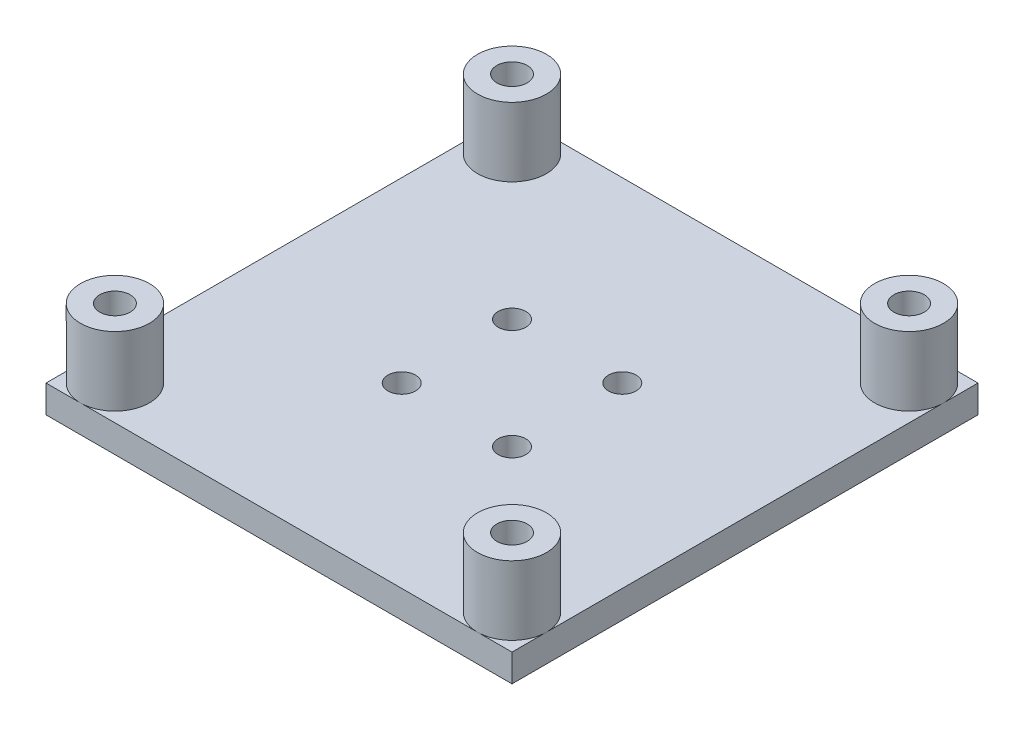
ISO-10303-21;
HEADER;
FILE_DESCRIPTION(('STEP AP214'),'2;1');
FILE_NAME('part.step','',(''),(''),'','','');
FILE_SCHEMA(('AUTOMOTIVE_DESIGN { 1 0 10303 214 1 1 1 1 }'));
ENDSEC;
DATA;
#1=APPLICATION_CONTEXT('core data for automotive mechanical design processes');
#2=APPLICATION_PROTOCOL_DEFINITION('international standard','automotive_design',2000,#1);
#3=PRODUCT_CONTEXT('',#1,'mechanical');
#4=PRODUCT('Part','Part','',(#3));
#5=PRODUCT_RELATED_PRODUCT_CATEGORY('part','',(#4));
#6=PRODUCT_DEFINITION_FORMATION('','',#4);
#7=PRODUCT_DEFINITION_CONTEXT('part definition',#1,'design');
#8=PRODUCT_DEFINITION('design','',#6,#7);
#9=PRODUCT_DEFINITION_SHAPE('','',#8);
#10=(LENGTH_UNIT() NAMED_UNIT(*) SI_UNIT(.MILLI.,.METRE.));
#11=(NAMED_UNIT(*) PLANE_ANGLE_UNIT() SI_UNIT($,.RADIAN.));
#12=(NAMED_UNIT(*) SI_UNIT($,.STERADIAN.) SOLID_ANGLE_UNIT());
#13=UNCERTAINTY_MEASURE_WITH_UNIT(LENGTH_MEASURE(1.E-05),#10,'distance_accuracy_value','');
#14=(GEOMETRIC_REPRESENTATION_CONTEXT(3) GLOBAL_UNCERTAINTY_ASSIGNED_CONTEXT((#13)) GLOBAL_UNIT_ASSIGNED_CONTEXT((#10,
#11,#12)) REPRESENTATION_CONTEXT('',''));
#15=CARTESIAN_POINT('',(0.,0.,0.));
#16=DIRECTION('',(0.,0.,1.));
#17=DIRECTION('',(1.,0.,0.));
#18=AXIS2_PLACEMENT_3D('',#15,#16,#17);
#19=CARTESIAN_POINT('',(0.,2.54,0.));
#20=DIRECTION('',(0.,1.,0.));
#21=DIRECTION('',(0.,0.,1.));
#22=AXIS2_PLACEMENT_3D('',#19,#20,#21);
#23=PLANE('',#22);
#24=DIRECTION('',(1.,0.,0.));
#25=VECTOR('',#24,1.);
#26=CARTESIAN_POINT('',(-48.8451315226756,2.54,23.6564176388459));
#27=LINE('',#26,#25);
#28=CARTESIAN_POINT('',(-48.8451315226756,2.54,23.6564176388459));
#29=VERTEX_POINT('',#28);
#30=CARTESIAN_POINT('',(-45.6701315226756,2.54,23.6564176388459));
#31=VERTEX_POINT('',#30);
#32=EDGE_CURVE('E108',#29,#31,#27,.T.);
#33=ORIENTED_EDGE('',*,*,#32,.T.);
#34=CARTESIAN_POINT('',(-45.6701315226756,2.54,20.4814176388459));
#35=DIRECTION('',(0.,1.,0.));
#36=DIRECTION('',(0.,0.,1.));
#37=AXIS2_PLACEMENT_3D('',#34,#35,#36);
#38=CIRCLE('',#37,3.17500000000002);
#39=CARTESIAN_POINT('',(-48.8451315226756,2.54,20.4814176388459));
#40=VERTEX_POINT('',#39);
#41=EDGE_CURVE('E49',#40,#31,#38,.T.);
#42=ORIENTED_EDGE('',*,*,#41,.F.);
#43=DIRECTION('',(0.,0.,1.));
#44=VECTOR('',#43,1.);
#45=CARTESIAN_POINT('',(-48.8451315226756,2.54,-19.2695823611541));
#46=LINE('',#45,#44);
#47=EDGE_CURVE('E106',#40,#29,#46,.T.);
#48=ORIENTED_EDGE('',*,*,#47,.T.);
#49=EDGE_LOOP('',(#33,#42,#48));
#50=FACE_BOUND('',#49,.T.);
#51=ADVANCED_FACE('F33',(#50),#23,.T.);
#52=CARTESIAN_POINT('',(-22.3021315226756,2.54,7.27341763884586));
#53=DIRECTION('',(0.,1.,0.));
#54=DIRECTION('',(0.,0.,1.));
#55=AXIS2_PLACEMENT_3D('',#52,#53,#54);
#56=CIRCLE('',#55,1.27);
#57=CARTESIAN_POINT('',(-22.3021315226756,2.54,8.54341763884586));
#58=VERTEX_POINT('',#57);
#59=EDGE_CURVE('E37',#58,#58,#56,.T.);
#60=ORIENTED_EDGE('',*,*,#59,.F.);
#61=EDGE_LOOP('',(#60));
#62=FACE_BOUND('',#61,.T.);
#63=CARTESIAN_POINT('',(-22.3021315226756,2.54,-2.88658236115414));
#64=DIRECTION('',(0.,1.,0.));
#65=DIRECTION('',(0.,0.,1.));
#66=AXIS2_PLACEMENT_3D('',#63,#64,#65);
#67=CIRCLE('',#66,1.27);
#68=CARTESIAN_POINT('',(-22.3021315226756,2.54,-1.61658236115414));
#69=VERTEX_POINT('',#68);
#70=EDGE_CURVE('E172',#69,#69,#67,.T.);
#71=ORIENTED_EDGE('',*,*,#70,.F.);
#72=EDGE_LOOP('',(#71));
#73=FACE_BOUND('',#72,.T.);
#74=CARTESIAN_POINT('',(-32.4621315226756,2.54,7.27341763884586));
#75=DIRECTION('',(0.,1.,0.));
#76=DIRECTION('',(0.,0.,1.));
#77=AXIS2_PLACEMENT_3D('',#74,#75,#76);
#78=CIRCLE('',#77,1.27);
#79=CARTESIAN_POINT('',(-32.4621315226756,2.54,8.54341763884585));
#80=VERTEX_POINT('',#79);
#81=EDGE_CURVE('E170',#80,#80,#78,.T.);
#82=ORIENTED_EDGE('',*,*,#81,.F.);
#83=EDGE_LOOP('',(#82));
#84=FACE_BOUND('',#83,.T.);
#85=CARTESIAN_POINT('',(-32.4621315226756,2.54,-2.88658236115415));
#86=DIRECTION('',(0.,1.,0.));
#87=DIRECTION('',(0.,0.,1.));
#88=AXIS2_PLACEMENT_3D('',#85,#86,#87);
#89=CIRCLE('',#88,1.27);
#90=CARTESIAN_POINT('',(-32.4621315226756,2.54,-1.61658236115415));
#91=VERTEX_POINT('',#90);
#92=EDGE_CURVE('E166',#91,#91,#89,.T.);
#93=ORIENTED_EDGE('',*,*,#92,.F.);
#94=EDGE_LOOP('',(#93));
#95=FACE_BOUND('',#94,.T.);
#96=CARTESIAN_POINT('',(-48.8451315226756,2.54,-16.0945823611541));
#97=VERTEX_POINT('',#96);
#98=EDGE_CURVE('E115',#97,#40,#46,.T.);
#99=ORIENTED_EDGE('',*,*,#98,.T.);
#100=EDGE_CURVE('E98',#31,#40,#38,.T.);
#101=ORIENTED_EDGE('',*,*,#100,.F.);
#102=CARTESIAN_POINT('',(-9.09413152267563,2.54,23.6564176388459));
#103=VERTEX_POINT('',#102);
#104=EDGE_CURVE('E56',#31,#103,#27,.T.);
#105=ORIENTED_EDGE('',*,*,#104,.T.);
#106=CARTESIAN_POINT('',(-9.09413152267563,2.54,20.4814176388459));
#107=DIRECTION('',(0.,1.,0.));
#108=DIRECTION('',(0.,0.,1.));
#109=AXIS2_PLACEMENT_3D('',#106,#107,#108);
#110=CIRCLE('',#109,3.175);
#111=CARTESIAN_POINT('',(-5.91913152267563,2.54,20.4814176388459));
#112=VERTEX_POINT('',#111);
#113=EDGE_CURVE('E250',#112,#103,#110,.T.);
#114=ORIENTED_EDGE('',*,*,#113,.F.);
#115=DIRECTION('',(0.,0.,-1.));
#116=VECTOR('',#115,1.);
#117=CARTESIAN_POINT('',(-5.91913152267563,2.54,-19.2695823611541));
#118=LINE('',#117,#116);
#119=CARTESIAN_POINT('',(-5.91913152267563,2.54,-16.0945823611541));
#120=VERTEX_POINT('',#119);
#121=EDGE_CURVE('E136',#112,#120,#118,.T.);
#122=ORIENTED_EDGE('',*,*,#121,.T.);
#123=CARTESIAN_POINT('',(-9.09413152267563,2.54,-16.0945823611541));
#124=DIRECTION('',(0.,1.,0.));
#125=DIRECTION('',(0.,0.,1.));
#126=AXIS2_PLACEMENT_3D('',#123,#124,#125);
#127=CIRCLE('',#126,3.175);
#128=CARTESIAN_POINT('',(-9.09413152267563,2.54,-19.2695823611541));
#129=VERTEX_POINT('',#128);
#130=EDGE_CURVE('E249',#129,#120,#127,.T.);
#131=ORIENTED_EDGE('',*,*,#130,.F.);
#132=DIRECTION('',(-1.,0.,0.));
#133=VECTOR('',#132,1.);
#134=CARTESIAN_POINT('',(-48.8451315226756,2.54,-19.2695823611541));
#135=LINE('',#134,#133);
#136=CARTESIAN_POINT('',(-45.6701315226756,2.54,-19.2695823611541));
#137=VERTEX_POINT('',#136);
#138=EDGE_CURVE('E141',#129,#137,#135,.T.);
#139=ORIENTED_EDGE('',*,*,#138,.T.);
#140=CARTESIAN_POINT('',(-45.6701315226756,2.54,-16.0945823611541));
#141=DIRECTION('',(0.,1.,0.));
#142=DIRECTION('',(0.,0.,1.));
#143=AXIS2_PLACEMENT_3D('',#140,#141,#142);
#144=CIRCLE('',#143,3.175);
#145=EDGE_CURVE('E124',#97,#137,#144,.T.);
#146=ORIENTED_EDGE('',*,*,#145,.F.);
#147=EDGE_LOOP('',(#99,#101,#105,#114,#122,#131,#139,#146));
#148=FACE_BOUND('',#147,.T.);
#149=ADVANCED_FACE('F122',(#62,#73,#84,#95,#148),#23,.T.);
#150=CARTESIAN_POINT('',(-5.91913152267563,2.54,23.6564176388459));
#151=VERTEX_POINT('',#150);
#152=EDGE_CURVE('E132',#151,#112,#118,.T.);
#153=ORIENTED_EDGE('',*,*,#152,.T.);
#154=EDGE_CURVE('E244',#103,#112,#110,.T.);
#155=ORIENTED_EDGE('',*,*,#154,.F.);
#156=EDGE_CURVE('E125',#103,#151,#27,.T.);
#157=ORIENTED_EDGE('',*,*,#156,.T.);
#158=EDGE_LOOP('',(#153,#155,#157));
#159=FACE_BOUND('',#158,.T.);
#160=ADVANCED_FACE('F183',(#159),#23,.T.);
#161=CARTESIAN_POINT('',(-5.91913152267563,2.54,-19.2695823611541));
#162=VERTEX_POINT('',#161);
#163=EDGE_CURVE('E137',#162,#129,#135,.T.);
#164=ORIENTED_EDGE('',*,*,#163,.T.);
#165=EDGE_CURVE('E221',#120,#129,#127,.T.);
#166=ORIENTED_EDGE('',*,*,#165,.F.);
#167=EDGE_CURVE('E131',#120,#162,#118,.T.);
#168=ORIENTED_EDGE('',*,*,#167,.T.);
#169=EDGE_LOOP('',(#164,#166,#168));
#170=FACE_BOUND('',#169,.T.);
#171=ADVANCED_FACE('F204',(#170),#23,.T.);
#172=EDGE_CURVE('E233',#137,#97,#144,.T.);
#173=ORIENTED_EDGE('',*,*,#172,.F.);
#174=CARTESIAN_POINT('',(-48.8451315226756,2.54,-19.2695823611541));
#175=VERTEX_POINT('',#174);
#176=EDGE_CURVE('E135',#137,#175,#135,.T.);
#177=ORIENTED_EDGE('',*,*,#176,.T.);
#178=EDGE_CURVE('E121',#175,#97,#46,.T.);
#179=ORIENTED_EDGE('',*,*,#178,.T.);
#180=EDGE_LOOP('',(#173,#177,#179));
#181=FACE_BOUND('',#180,.T.);
#182=ADVANCED_FACE('F210',(#181),#23,.T.);
#183=CARTESIAN_POINT('',(0.,0.,0.));
#184=DIRECTION('',(0.,1.,0.));
#185=DIRECTION('',(0.,0.,1.));
#186=AXIS2_PLACEMENT_3D('',#183,#184,#185);
#187=PLANE('',#186);
#188=CARTESIAN_POINT('',(-32.4621315226756,0.,-2.88658236115415));
#189=DIRECTION('',(0.,1.,0.));
#190=DIRECTION('',(0.,0.,1.));
#191=AXIS2_PLACEMENT_3D('',#188,#189,#190);
#192=CIRCLE('',#191,3.175);
#193=CARTESIAN_POINT('',(-32.4621315226756,0.,0.288417638845856));
#194=VERTEX_POINT('',#193);
#195=EDGE_CURVE('E11',#194,#194,#192,.F.);
#196=ORIENTED_EDGE('',*,*,#195,.F.);
#197=EDGE_LOOP('',(#196));
#198=FACE_BOUND('',#197,.T.);
#199=CARTESIAN_POINT('',(-22.3021315226756,0.,-2.88658236115414));
#200=DIRECTION('',(0.,1.,0.));
#201=DIRECTION('',(0.,0.,1.));
#202=AXIS2_PLACEMENT_3D('',#199,#200,#201);
#203=CIRCLE('',#202,3.175);
#204=CARTESIAN_POINT('',(-22.3021315226756,0.,0.288417638845859));
#205=VERTEX_POINT('',#204);
#206=EDGE_CURVE('E42',#205,#205,#203,.F.);
#207=ORIENTED_EDGE('',*,*,#206,.F.);
#208=EDGE_LOOP('',(#207));
#209=FACE_BOUND('',#208,.T.);
#210=CARTESIAN_POINT('',(-22.3021315226756,0.,7.27341763884586));
#211=DIRECTION('',(0.,1.,0.));
#212=DIRECTION('',(0.,0.,1.));
#213=AXIS2_PLACEMENT_3D('',#210,#211,#212);
#214=CIRCLE('',#213,3.175);
#215=CARTESIAN_POINT('',(-22.3021315226756,0.,10.4484176388459));
#216=VERTEX_POINT('',#215);
#217=EDGE_CURVE('E161',#216,#216,#214,.F.);
#218=ORIENTED_EDGE('',*,*,#217,.F.);
#219=EDGE_LOOP('',(#218));
#220=FACE_BOUND('',#219,.T.);
#221=CARTESIAN_POINT('',(-32.4621315226756,0.,7.27341763884586));
#222=DIRECTION('',(0.,1.,0.));
#223=DIRECTION('',(0.,0.,1.));
#224=AXIS2_PLACEMENT_3D('',#221,#222,#223);
#225=CIRCLE('',#224,3.175);
#226=CARTESIAN_POINT('',(-32.4621315226756,0.,10.4484176388459));
#227=VERTEX_POINT('',#226);
#228=EDGE_CURVE('E158',#227,#227,#225,.F.);
#229=ORIENTED_EDGE('',*,*,#228,.F.);
#230=EDGE_LOOP('',(#229));
#231=FACE_BOUND('',#230,.T.);
#232=DIRECTION('',(0.,0.,1.));
#233=VECTOR('',#232,1.);
#234=CARTESIAN_POINT('',(-48.8451315226756,0.,-19.2695823611541));
#235=LINE('',#234,#233);
#236=CARTESIAN_POINT('',(-48.8451315226756,0.,-19.2695823611541));
#237=VERTEX_POINT('',#236);
#238=CARTESIAN_POINT('',(-48.8451315226756,0.,23.6564176388459));
#239=VERTEX_POINT('',#238);
#240=EDGE_CURVE('E142',#237,#239,#235,.T.);
#241=ORIENTED_EDGE('',*,*,#240,.F.);
#242=DIRECTION('',(-1.,0.,0.));
#243=VECTOR('',#242,1.);
#244=CARTESIAN_POINT('',(-48.8451315226756,0.,-19.2695823611541));
#245=LINE('',#244,#243);
#246=CARTESIAN_POINT('',(-5.91913152267563,0.,-19.2695823611541));
#247=VERTEX_POINT('',#246);
#248=EDGE_CURVE('E119',#247,#237,#245,.T.);
#249=ORIENTED_EDGE('',*,*,#248,.F.);
#250=DIRECTION('',(0.,0.,-1.));
#251=VECTOR('',#250,1.);
#252=CARTESIAN_POINT('',(-5.91913152267563,0.,-19.2695823611541));
#253=LINE('',#252,#251);
#254=CARTESIAN_POINT('',(-5.91913152267563,0.,23.6564176388459));
#255=VERTEX_POINT('',#254);
#256=EDGE_CURVE('E146',#255,#247,#253,.T.);
#257=ORIENTED_EDGE('',*,*,#256,.F.);
#258=DIRECTION('',(1.,0.,0.));
#259=VECTOR('',#258,1.);
#260=CARTESIAN_POINT('',(-48.8451315226756,0.,23.6564176388459));
#261=LINE('',#260,#259);
#262=EDGE_CURVE('E144',#239,#255,#261,.T.);
#263=ORIENTED_EDGE('',*,*,#262,.F.);
#264=EDGE_LOOP('',(#241,#249,#257,#263));
#265=FACE_BOUND('',#264,.T.);
#266=CARTESIAN_POINT('',(-45.6701315226756,0.,-16.0945823611541));
#267=DIRECTION('',(0.,1.,0.));
#268=DIRECTION('',(0.,0.,1.));
#269=AXIS2_PLACEMENT_3D('',#266,#267,#268);
#270=CIRCLE('',#269,1.39700000000001);
#271=CARTESIAN_POINT('',(-45.6701315226756,0.,-14.6975823611541));
#272=VERTEX_POINT('',#271);
#273=EDGE_CURVE('E128',#272,#272,#270,.T.);
#274=ORIENTED_EDGE('',*,*,#273,.T.);
#275=EDGE_LOOP('',(#274));
#276=FACE_BOUND('',#275,.T.);
#277=CARTESIAN_POINT('',(-9.09413152267563,0.,-16.0945823611541));
#278=DIRECTION('',(0.,1.,0.));
#279=DIRECTION('',(0.,0.,1.));
#280=AXIS2_PLACEMENT_3D('',#277,#278,#279);
#281=CIRCLE('',#280,1.397);
#282=CARTESIAN_POINT('',(-9.09413152267563,0.,-14.6975823611541));
#283=VERTEX_POINT('',#282);
#284=EDGE_CURVE('E273',#283,#283,#281,.T.);
#285=ORIENTED_EDGE('',*,*,#284,.T.);
#286=EDGE_LOOP('',(#285));
#287=FACE_BOUND('',#286,.T.);
#288=CARTESIAN_POINT('',(-45.6701315226756,0.,20.4814176388459));
#289=DIRECTION('',(0.,1.,0.));
#290=DIRECTION('',(0.,0.,1.));
#291=AXIS2_PLACEMENT_3D('',#288,#289,#290);
#292=CIRCLE('',#291,1.39700000000001);
#293=CARTESIAN_POINT('',(-45.6701315226756,0.,21.8784176388459));
#294=VERTEX_POINT('',#293);
#295=EDGE_CURVE('E271',#294,#294,#292,.T.);
#296=ORIENTED_EDGE('',*,*,#295,.T.);
#297=EDGE_LOOP('',(#296));
#298=FACE_BOUND('',#297,.T.);
#299=CARTESIAN_POINT('',(-9.09413152267563,0.,20.4814176388459));
#300=DIRECTION('',(0.,1.,0.));
#301=DIRECTION('',(0.,0.,1.));
#302=AXIS2_PLACEMENT_3D('',#299,#300,#301);
#303=CIRCLE('',#302,1.397);
#304=CARTESIAN_POINT('',(-9.09413152267563,0.,21.8784176388459));
#305=VERTEX_POINT('',#304);
#306=EDGE_CURVE('E267',#305,#305,#303,.T.);
#307=ORIENTED_EDGE('',*,*,#306,.T.);
#308=EDGE_LOOP('',(#307));
#309=FACE_BOUND('',#308,.T.);
#310=ADVANCED_FACE('F216',(#198,#209,#220,#231,#265,#276,#287,#298,#309),#187,.F.);
#311=CARTESIAN_POINT('',(-48.8451315226756,2.54,-19.2695823611541));
#312=DIRECTION('',(1.,0.,0.));
#313=DIRECTION('',(0.,0.,-1.));
#314=AXIS2_PLACEMENT_3D('',#311,#312,#313);
#315=PLANE('',#314);
#316=ORIENTED_EDGE('',*,*,#240,.T.);
#317=DIRECTION('',(0.,-1.,0.));
#318=VECTOR('',#317,1.);
#319=CARTESIAN_POINT('',(-48.8451315226756,2.54,23.6564176388459));
#320=LINE('',#319,#318);
#321=EDGE_CURVE('E118',#29,#239,#320,.T.);
#322=ORIENTED_EDGE('',*,*,#321,.F.);
#323=ORIENTED_EDGE('',*,*,#47,.F.);
#324=ORIENTED_EDGE('',*,*,#98,.F.);
#325=ORIENTED_EDGE('',*,*,#178,.F.);
#326=DIRECTION('',(0.,-1.,0.));
#327=VECTOR('',#326,1.);
#328=CARTESIAN_POINT('',(-48.8451315226756,2.54,-19.2695823611541));
#329=LINE('',#328,#327);
#330=EDGE_CURVE('E140',#175,#237,#329,.T.);
#331=ORIENTED_EDGE('',*,*,#330,.T.);
#332=EDGE_LOOP('',(#316,#322,#323,#324,#325,#331));
#333=FACE_BOUND('',#332,.T.);
#334=ADVANCED_FACE('F35',(#333),#315,.F.);
#335=CARTESIAN_POINT('',(-48.8451315226756,2.54,23.6564176388459));
#336=DIRECTION('',(0.,0.,-1.));
#337=DIRECTION('',(-1.,0.,0.));
#338=AXIS2_PLACEMENT_3D('',#335,#336,#337);
#339=PLANE('',#338);
#340=ORIENTED_EDGE('',*,*,#262,.T.);
#341=DIRECTION('',(0.,-1.,0.));
#342=VECTOR('',#341,1.);
#343=CARTESIAN_POINT('',(-5.91913152267563,2.54,23.6564176388459));
#344=LINE('',#343,#342);
#345=EDGE_CURVE('E154',#151,#255,#344,.T.);
#346=ORIENTED_EDGE('',*,*,#345,.F.);
#347=ORIENTED_EDGE('',*,*,#156,.F.);
#348=ORIENTED_EDGE('',*,*,#104,.F.);
#349=ORIENTED_EDGE('',*,*,#32,.F.);
#350=ORIENTED_EDGE('',*,*,#321,.T.);
#351=EDGE_LOOP('',(#340,#346,#347,#348,#349,#350));
#352=FACE_BOUND('',#351,.T.);
#353=ADVANCED_FACE('F240',(#352),#339,.F.);
#354=CARTESIAN_POINT('',(-5.91913152267563,2.54,-19.2695823611541));
#355=DIRECTION('',(-1.,0.,0.));
#356=DIRECTION('',(0.,0.,1.));
#357=AXIS2_PLACEMENT_3D('',#354,#355,#356);
#358=PLANE('',#357);
#359=ORIENTED_EDGE('',*,*,#256,.T.);
#360=DIRECTION('',(0.,-1.,0.));
#361=VECTOR('',#360,1.);
#362=CARTESIAN_POINT('',(-5.91913152267563,2.54,-19.2695823611541));
#363=LINE('',#362,#361);
#364=EDGE_CURVE('E151',#162,#247,#363,.T.);
#365=ORIENTED_EDGE('',*,*,#364,.F.);
#366=ORIENTED_EDGE('',*,*,#167,.F.);
#367=ORIENTED_EDGE('',*,*,#121,.F.);
#368=ORIENTED_EDGE('',*,*,#152,.F.);
#369=ORIENTED_EDGE('',*,*,#345,.T.);
#370=EDGE_LOOP('',(#359,#365,#366,#367,#368,#369));
#371=FACE_BOUND('',#370,.T.);
#372=ADVANCED_FACE('F247',(#371),#358,.F.);
#373=CARTESIAN_POINT('',(-48.8451315226756,2.54,-19.2695823611541));
#374=DIRECTION('',(0.,0.,1.));
#375=DIRECTION('',(1.,0.,0.));
#376=AXIS2_PLACEMENT_3D('',#373,#374,#375);
#377=PLANE('',#376);
#378=ORIENTED_EDGE('',*,*,#248,.T.);
#379=ORIENTED_EDGE('',*,*,#330,.F.);
#380=ORIENTED_EDGE('',*,*,#176,.F.);
#381=ORIENTED_EDGE('',*,*,#138,.F.);
#382=ORIENTED_EDGE('',*,*,#163,.F.);
#383=ORIENTED_EDGE('',*,*,#364,.T.);
#384=EDGE_LOOP('',(#378,#379,#380,#381,#382,#383));
#385=FACE_BOUND('',#384,.T.);
#386=ADVANCED_FACE('F226',(#385),#377,.F.);
#387=CARTESIAN_POINT('',(-45.6701315226756,2.54,-16.0945823611541));
#388=DIRECTION('',(0.,-1.,0.));
#389=DIRECTION('',(0.,0.,-1.));
#390=AXIS2_PLACEMENT_3D('',#387,#388,#389);
#391=CYLINDRICAL_SURFACE('',#390,1.39700000000001);
#392=ORIENTED_EDGE('',*,*,#273,.F.);
#393=EDGE_LOOP('',(#392));
#394=FACE_BOUND('',#393,.T.);
#395=CARTESIAN_POINT('',(-45.6701315226756,8.89,-16.0945823611541));
#396=DIRECTION('',(0.,1.,0.));
#397=DIRECTION('',(0.,0.,1.));
#398=AXIS2_PLACEMENT_3D('',#395,#396,#397);
#399=CIRCLE('',#398,1.39700000000001);
#400=CARTESIAN_POINT('',(-45.6701315226756,8.89,-14.6975823611541));
#401=VERTEX_POINT('',#400);
#402=EDGE_CURVE('E261',#401,#401,#399,.T.);
#403=ORIENTED_EDGE('',*,*,#402,.T.);
#404=EDGE_LOOP('',(#403));
#405=FACE_BOUND('',#404,.T.);
#406=ADVANCED_FACE('F280',(#394,#405),#391,.F.);
#407=CARTESIAN_POINT('',(-9.09413152267563,2.54,-16.0945823611541));
#408=DIRECTION('',(0.,-1.,0.));
#409=DIRECTION('',(0.,0.,-1.));
#410=AXIS2_PLACEMENT_3D('',#407,#408,#409);
#411=CYLINDRICAL_SURFACE('',#410,1.397);
#412=ORIENTED_EDGE('',*,*,#284,.F.);
#413=EDGE_LOOP('',(#412));
#414=FACE_BOUND('',#413,.T.);
#415=CARTESIAN_POINT('',(-9.09413152267563,8.89,-16.0945823611541));
#416=DIRECTION('',(0.,1.,0.));
#417=DIRECTION('',(0.,0.,1.));
#418=AXIS2_PLACEMENT_3D('',#415,#416,#417);
#419=CIRCLE('',#418,1.397);
#420=CARTESIAN_POINT('',(-9.09413152267563,8.89,-14.6975823611541));
#421=VERTEX_POINT('',#420);
#422=EDGE_CURVE('E253',#421,#421,#419,.T.);
#423=ORIENTED_EDGE('',*,*,#422,.T.);
#424=EDGE_LOOP('',(#423));
#425=FACE_BOUND('',#424,.T.);
#426=ADVANCED_FACE('F283',(#414,#425),#411,.F.);
#427=CARTESIAN_POINT('',(-45.6701315226756,2.54,20.4814176388459));
#428=DIRECTION('',(0.,-1.,0.));
#429=DIRECTION('',(0.,0.,-1.));
#430=AXIS2_PLACEMENT_3D('',#427,#428,#429);
#431=CYLINDRICAL_SURFACE('',#430,1.39700000000001);
#432=ORIENTED_EDGE('',*,*,#295,.F.);
#433=EDGE_LOOP('',(#432));
#434=FACE_BOUND('',#433,.T.);
#435=CARTESIAN_POINT('',(-45.6701315226756,8.89,20.4814176388459));
#436=DIRECTION('',(0.,1.,0.));
#437=DIRECTION('',(0.,0.,1.));
#438=AXIS2_PLACEMENT_3D('',#435,#436,#437);
#439=CIRCLE('',#438,1.39700000000001);
#440=CARTESIAN_POINT('',(-45.6701315226756,8.89,21.8784176388459));
#441=VERTEX_POINT('',#440);
#442=EDGE_CURVE('E109',#441,#441,#439,.T.);
#443=ORIENTED_EDGE('',*,*,#442,.T.);
#444=EDGE_LOOP('',(#443));
#445=FACE_BOUND('',#444,.T.);
#446=ADVANCED_FACE('F299',(#434,#445),#431,.F.);
#447=CARTESIAN_POINT('',(-9.09413152267563,2.54,20.4814176388459));
#448=DIRECTION('',(0.,-1.,0.));
#449=DIRECTION('',(0.,0.,-1.));
#450=AXIS2_PLACEMENT_3D('',#447,#448,#449);
#451=CYLINDRICAL_SURFACE('',#450,1.397);
#452=ORIENTED_EDGE('',*,*,#306,.F.);
#453=EDGE_LOOP('',(#452));
#454=FACE_BOUND('',#453,.T.);
#455=CARTESIAN_POINT('',(-9.09413152267563,8.89,20.4814176388459));
#456=DIRECTION('',(0.,1.,0.));
#457=DIRECTION('',(0.,0.,1.));
#458=AXIS2_PLACEMENT_3D('',#455,#456,#457);
#459=CIRCLE('',#458,1.397);
#460=CARTESIAN_POINT('',(-9.09413152267563,8.89,21.8784176388459));
#461=VERTEX_POINT('',#460);
#462=EDGE_CURVE('E405',#461,#461,#459,.T.);
#463=ORIENTED_EDGE('',*,*,#462,.T.);
#464=EDGE_LOOP('',(#463));
#465=FACE_BOUND('',#464,.T.);
#466=ADVANCED_FACE('F289',(#454,#465),#451,.F.);
#467=CARTESIAN_POINT('',(-45.6701315226756,8.89,-16.0945823611541));
#468=DIRECTION('',(0.,1.,0.));
#469=DIRECTION('',(0.,0.,1.));
#470=AXIS2_PLACEMENT_3D('',#467,#468,#469);
#471=PLANE('',#470);
#472=CARTESIAN_POINT('',(-45.6701315226756,8.89,-16.0945823611541));
#473=DIRECTION('',(0.,1.,0.));
#474=DIRECTION('',(0.,0.,1.));
#475=AXIS2_PLACEMENT_3D('',#472,#473,#474);
#476=CIRCLE('',#475,3.175);
#477=CARTESIAN_POINT('',(-45.6701315226756,8.89,-12.9195823611541));
#478=VERTEX_POINT('',#477);
#479=EDGE_CURVE('E264',#478,#478,#476,.T.);
#480=ORIENTED_EDGE('',*,*,#479,.T.);
#481=EDGE_LOOP('',(#480));
#482=FACE_BOUND('',#481,.T.);
#483=ORIENTED_EDGE('',*,*,#402,.F.);
#484=EDGE_LOOP('',(#483));
#485=FACE_BOUND('',#484,.T.);
#486=ADVANCED_FACE('F286',(#482,#485),#471,.T.);
#487=CARTESIAN_POINT('',(-45.6701315226756,8.89,-16.0945823611541));
#488=DIRECTION('',(0.,-1.,0.));
#489=DIRECTION('',(0.,0.,-1.));
#490=AXIS2_PLACEMENT_3D('',#487,#488,#489);
#491=CYLINDRICAL_SURFACE('',#490,3.175);
#492=ORIENTED_EDGE('',*,*,#479,.F.);
#493=EDGE_LOOP('',(#492));
#494=FACE_BOUND('',#493,.T.);
#495=ORIENTED_EDGE('',*,*,#172,.T.);
#496=ORIENTED_EDGE('',*,*,#145,.T.);
#497=EDGE_LOOP('',(#495,#496));
#498=FACE_BOUND('',#497,.T.);
#499=ADVANCED_FACE('F288',(#494,#498),#491,.T.);
#500=CARTESIAN_POINT('',(-9.09413152267563,8.89,-16.0945823611541));
#501=DIRECTION('',(0.,1.,0.));
#502=DIRECTION('',(0.,0.,1.));
#503=AXIS2_PLACEMENT_3D('',#500,#501,#502);
#504=PLANE('',#503);
#505=CARTESIAN_POINT('',(-9.09413152267563,8.89,-16.0945823611541));
#506=DIRECTION('',(0.,1.,0.));
#507=DIRECTION('',(0.,0.,1.));
#508=AXIS2_PLACEMENT_3D('',#505,#506,#507);
#509=CIRCLE('',#508,3.175);
#510=CARTESIAN_POINT('',(-9.09413152267563,8.89,-12.9195823611541));
#511=VERTEX_POINT('',#510);
#512=EDGE_CURVE('E255',#511,#511,#509,.T.);
#513=ORIENTED_EDGE('',*,*,#512,.T.);
#514=EDGE_LOOP('',(#513));
#515=FACE_BOUND('',#514,.T.);
#516=ORIENTED_EDGE('',*,*,#422,.F.);
#517=EDGE_LOOP('',(#516));
#518=FACE_BOUND('',#517,.T.);
#519=ADVANCED_FACE('F296',(#515,#518),#504,.T.);
#520=CARTESIAN_POINT('',(-9.09413152267563,8.89,-16.0945823611541));
#521=DIRECTION('',(0.,-1.,0.));
#522=DIRECTION('',(0.,0.,-1.));
#523=AXIS2_PLACEMENT_3D('',#520,#521,#522);
#524=CYLINDRICAL_SURFACE('',#523,3.175);
#525=ORIENTED_EDGE('',*,*,#512,.F.);
#526=EDGE_LOOP('',(#525));
#527=FACE_BOUND('',#526,.T.);
#528=ORIENTED_EDGE('',*,*,#165,.T.);
#529=ORIENTED_EDGE('',*,*,#130,.T.);
#530=EDGE_LOOP('',(#528,#529));
#531=FACE_BOUND('',#530,.T.);
#532=ADVANCED_FACE('F252',(#527,#531),#524,.T.);
#533=CARTESIAN_POINT('',(-9.09413152267563,8.89,20.4814176388459));
#534=DIRECTION('',(0.,1.,0.));
#535=DIRECTION('',(0.,0.,1.));
#536=AXIS2_PLACEMENT_3D('',#533,#534,#535);
#537=PLANE('',#536);
#538=CARTESIAN_POINT('',(-9.09413152267563,8.89,20.4814176388459));
#539=DIRECTION('',(0.,1.,0.));
#540=DIRECTION('',(0.,0.,1.));
#541=AXIS2_PLACEMENT_3D('',#538,#539,#540);
#542=CIRCLE('',#541,3.175);
#543=CARTESIAN_POINT('',(-9.09413152267563,8.89,23.6564176388459));
#544=VERTEX_POINT('',#543);
#545=EDGE_CURVE('E257',#544,#544,#542,.T.);
#546=ORIENTED_EDGE('',*,*,#545,.T.);
#547=EDGE_LOOP('',(#546));
#548=FACE_BOUND('',#547,.T.);
#549=ORIENTED_EDGE('',*,*,#462,.F.);
#550=EDGE_LOOP('',(#549));
#551=FACE_BOUND('',#550,.T.);
#552=ADVANCED_FACE('F320',(#548,#551),#537,.T.);
#553=CARTESIAN_POINT('',(-9.09413152267563,8.89,20.4814176388459));
#554=DIRECTION('',(0.,-1.,0.));
#555=DIRECTION('',(0.,0.,-1.));
#556=AXIS2_PLACEMENT_3D('',#553,#554,#555);
#557=CYLINDRICAL_SURFACE('',#556,3.175);
#558=ORIENTED_EDGE('',*,*,#545,.F.);
#559=EDGE_LOOP('',(#558));
#560=FACE_BOUND('',#559,.T.);
#561=ORIENTED_EDGE('',*,*,#154,.T.);
#562=ORIENTED_EDGE('',*,*,#113,.T.);
#563=EDGE_LOOP('',(#561,#562));
#564=FACE_BOUND('',#563,.T.);
#565=ADVANCED_FACE('F324',(#560,#564),#557,.T.);
#566=CARTESIAN_POINT('',(-45.6701315226756,8.89,20.4814176388459));
#567=DIRECTION('',(0.,1.,0.));
#568=DIRECTION('',(0.,0.,1.));
#569=AXIS2_PLACEMENT_3D('',#566,#567,#568);
#570=PLANE('',#569);
#571=CARTESIAN_POINT('',(-45.6701315226756,8.89,20.4814176388459));
#572=DIRECTION('',(0.,1.,0.));
#573=DIRECTION('',(0.,0.,1.));
#574=AXIS2_PLACEMENT_3D('',#571,#572,#573);
#575=CIRCLE('',#574,3.17500000000002);
#576=CARTESIAN_POINT('',(-45.6701315226756,8.89,23.6564176388459));
#577=VERTEX_POINT('',#576);
#578=EDGE_CURVE('E101',#577,#577,#575,.T.);
#579=ORIENTED_EDGE('',*,*,#578,.T.);
#580=EDGE_LOOP('',(#579));
#581=FACE_BOUND('',#580,.T.);
#582=ORIENTED_EDGE('',*,*,#442,.F.);
#583=EDGE_LOOP('',(#582));
#584=FACE_BOUND('',#583,.T.);
#585=ADVANCED_FACE('F327',(#581,#584),#570,.T.);
#586=CARTESIAN_POINT('',(-45.6701315226756,8.89,20.4814176388459));
#587=DIRECTION('',(0.,-1.,0.));
#588=DIRECTION('',(0.,0.,-1.));
#589=AXIS2_PLACEMENT_3D('',#586,#587,#588);
#590=CYLINDRICAL_SURFACE('',#589,3.17500000000002);
#591=ORIENTED_EDGE('',*,*,#578,.F.);
#592=EDGE_LOOP('',(#591));
#593=FACE_BOUND('',#592,.T.);
#594=ORIENTED_EDGE('',*,*,#100,.T.);
#595=ORIENTED_EDGE('',*,*,#41,.T.);
#596=EDGE_LOOP('',(#594,#595));
#597=FACE_BOUND('',#596,.T.);
#598=ADVANCED_FACE('F99',(#593,#597),#590,.T.);
#599=CARTESIAN_POINT('',(-32.4621315226756,-6.35,7.27341763884586));
#600=DIRECTION('',(0.,-1.,0.));
#601=DIRECTION('',(0.,0.,-1.));
#602=AXIS2_PLACEMENT_3D('',#599,#600,#601);
#603=PLANE('',#602);
#604=CARTESIAN_POINT('',(-32.4621315226756,-6.35,7.27341763884586));
#605=DIRECTION('',(0.,-1.,0.));
#606=DIRECTION('',(0.,0.,-1.));
#607=AXIS2_PLACEMENT_3D('',#604,#605,#606);
#608=CIRCLE('',#607,3.175);
#609=CARTESIAN_POINT('',(-32.4621315226756,-6.35,4.09841763884585));
#610=VERTEX_POINT('',#609);
#611=EDGE_CURVE('E399',#610,#610,#608,.T.);
#612=ORIENTED_EDGE('',*,*,#611,.T.);
#613=EDGE_LOOP('',(#612));
#614=FACE_BOUND('',#613,.T.);
#615=CARTESIAN_POINT('',(-32.4621315226756,-6.35,7.27341763884586));
#616=DIRECTION('',(0.,-1.,0.));
#617=DIRECTION('',(0.,0.,-1.));
#618=AXIS2_PLACEMENT_3D('',#615,#616,#617);
#619=CIRCLE('',#618,1.27);
#620=CARTESIAN_POINT('',(-32.4621315226756,-6.35,6.00341763884586));
#621=VERTEX_POINT('',#620);
#622=EDGE_CURVE('E396',#621,#621,#619,.T.);
#623=ORIENTED_EDGE('',*,*,#622,.F.);
#624=EDGE_LOOP('',(#623));
#625=FACE_BOUND('',#624,.T.);
#626=ADVANCED_FACE('F334',(#614,#625),#603,.T.);
#627=CARTESIAN_POINT('',(-32.4621315226756,-6.35,7.27341763884586));
#628=DIRECTION('',(0.,1.,0.));
#629=DIRECTION('',(0.,0.,1.));
#630=AXIS2_PLACEMENT_3D('',#627,#628,#629);
#631=CYLINDRICAL_SURFACE('',#630,3.175);
#632=ORIENTED_EDGE('',*,*,#611,.F.);
#633=EDGE_LOOP('',(#632));
#634=FACE_BOUND('',#633,.T.);
#635=ORIENTED_EDGE('',*,*,#228,.T.);
#636=EDGE_LOOP('',(#635));
#637=FACE_BOUND('',#636,.T.);
#638=ADVANCED_FACE('F339',(#634,#637),#631,.T.);
#639=CARTESIAN_POINT('',(-32.4621315226756,-6.35,7.27341763884586));
#640=DIRECTION('',(0.,1.,0.));
#641=DIRECTION('',(0.,0.,1.));
#642=AXIS2_PLACEMENT_3D('',#639,#640,#641);
#643=CYLINDRICAL_SURFACE('',#642,1.27);
#644=ORIENTED_EDGE('',*,*,#622,.T.);
#645=EDGE_LOOP('',(#644));
#646=FACE_BOUND('',#645,.T.);
#647=ORIENTED_EDGE('',*,*,#81,.T.);
#648=EDGE_LOOP('',(#647));
#649=FACE_BOUND('',#648,.T.);
#650=ADVANCED_FACE('F342',(#646,#649),#643,.F.);
#651=CARTESIAN_POINT('',(-22.3021315226756,-6.35,7.27341763884586));
#652=DIRECTION('',(0.,-1.,0.));
#653=DIRECTION('',(0.,0.,-1.));
#654=AXIS2_PLACEMENT_3D('',#651,#652,#653);
#655=PLANE('',#654);
#656=CARTESIAN_POINT('',(-22.3021315226756,-6.35,7.27341763884586));
#657=DIRECTION('',(0.,-1.,0.));
#658=DIRECTION('',(0.,0.,-1.));
#659=AXIS2_PLACEMENT_3D('',#656,#657,#658);
#660=CIRCLE('',#659,3.175);
#661=CARTESIAN_POINT('',(-22.3021315226756,-6.35,4.09841763884586));
#662=VERTEX_POINT('',#661);
#663=EDGE_CURVE('E393',#662,#662,#660,.T.);
#664=ORIENTED_EDGE('',*,*,#663,.T.);
#665=EDGE_LOOP('',(#664));
#666=FACE_BOUND('',#665,.T.);
#667=CARTESIAN_POINT('',(-22.3021315226756,-6.35,7.27341763884586));
#668=DIRECTION('',(0.,-1.,0.));
#669=DIRECTION('',(0.,0.,-1.));
#670=AXIS2_PLACEMENT_3D('',#667,#668,#669);
#671=CIRCLE('',#670,1.27);
#672=CARTESIAN_POINT('',(-22.3021315226756,-6.35,6.00341763884586));
#673=VERTEX_POINT('',#672);
#674=EDGE_CURVE('E390',#673,#673,#671,.T.);
#675=ORIENTED_EDGE('',*,*,#674,.F.);
#676=EDGE_LOOP('',(#675));
#677=FACE_BOUND('',#676,.T.);
#678=ADVANCED_FACE('F349',(#666,#677),#655,.T.);
#679=CARTESIAN_POINT('',(-22.3021315226756,-6.35,7.27341763884586));
#680=DIRECTION('',(0.,1.,0.));
#681=DIRECTION('',(0.,0.,1.));
#682=AXIS2_PLACEMENT_3D('',#679,#680,#681);
#683=CYLINDRICAL_SURFACE('',#682,3.175);
#684=ORIENTED_EDGE('',*,*,#663,.F.);
#685=EDGE_LOOP('',(#684));
#686=FACE_BOUND('',#685,.T.);
#687=ORIENTED_EDGE('',*,*,#217,.T.);
#688=EDGE_LOOP('',(#687));
#689=FACE_BOUND('',#688,.T.);
#690=ADVANCED_FACE('F351',(#686,#689),#683,.T.);
#691=CARTESIAN_POINT('',(-22.3021315226756,-6.35,7.27341763884586));
#692=DIRECTION('',(0.,1.,0.));
#693=DIRECTION('',(0.,0.,1.));
#694=AXIS2_PLACEMENT_3D('',#691,#692,#693);
#695=CYLINDRICAL_SURFACE('',#694,1.27);
#696=ORIENTED_EDGE('',*,*,#674,.T.);
#697=EDGE_LOOP('',(#696));
#698=FACE_BOUND('',#697,.T.);
#699=ORIENTED_EDGE('',*,*,#59,.T.);
#700=EDGE_LOOP('',(#699));
#701=FACE_BOUND('',#700,.T.);
#702=ADVANCED_FACE('F179',(#698,#701),#695,.F.);
#703=CARTESIAN_POINT('',(-22.3021315226756,-6.35,-2.88658236115414));
#704=DIRECTION('',(0.,-1.,0.));
#705=DIRECTION('',(0.,0.,-1.));
#706=AXIS2_PLACEMENT_3D('',#703,#704,#705);
#707=PLANE('',#706);
#708=CARTESIAN_POINT('',(-22.3021315226756,-6.35,-2.88658236115414));
#709=DIRECTION('',(0.,-1.,0.));
#710=DIRECTION('',(0.,0.,-1.));
#711=AXIS2_PLACEMENT_3D('',#708,#709,#710);
#712=CIRCLE('',#711,3.175);
#713=CARTESIAN_POINT('',(-22.3021315226756,-6.35,-6.06158236115414));
#714=VERTEX_POINT('',#713);
#715=EDGE_CURVE('E387',#714,#714,#712,.T.);
#716=ORIENTED_EDGE('',*,*,#715,.T.);
#717=EDGE_LOOP('',(#716));
#718=FACE_BOUND('',#717,.T.);
#719=CARTESIAN_POINT('',(-22.3021315226756,-6.35,-2.88658236115414));
#720=DIRECTION('',(0.,-1.,0.));
#721=DIRECTION('',(0.,0.,-1.));
#722=AXIS2_PLACEMENT_3D('',#719,#720,#721);
#723=CIRCLE('',#722,1.27);
#724=CARTESIAN_POINT('',(-22.3021315226756,-6.35,-4.15658236115414));
#725=VERTEX_POINT('',#724);
#726=EDGE_CURVE('E382',#725,#725,#723,.T.);
#727=ORIENTED_EDGE('',*,*,#726,.F.);
#728=EDGE_LOOP('',(#727));
#729=FACE_BOUND('',#728,.T.);
#730=ADVANCED_FACE('F360',(#718,#729),#707,.T.);
#731=CARTESIAN_POINT('',(-22.3021315226756,-6.35,-2.88658236115414));
#732=DIRECTION('',(0.,1.,0.));
#733=DIRECTION('',(0.,0.,1.));
#734=AXIS2_PLACEMENT_3D('',#731,#732,#733);
#735=CYLINDRICAL_SURFACE('',#734,3.175);
#736=ORIENTED_EDGE('',*,*,#715,.F.);
#737=EDGE_LOOP('',(#736));
#738=FACE_BOUND('',#737,.T.);
#739=ORIENTED_EDGE('',*,*,#206,.T.);
#740=EDGE_LOOP('',(#739));
#741=FACE_BOUND('',#740,.T.);
#742=ADVANCED_FACE('F362',(#738,#741),#735,.T.);
#743=CARTESIAN_POINT('',(-22.3021315226756,-6.35,-2.88658236115414));
#744=DIRECTION('',(0.,1.,0.));
#745=DIRECTION('',(0.,0.,1.));
#746=AXIS2_PLACEMENT_3D('',#743,#744,#745);
#747=CYLINDRICAL_SURFACE('',#746,1.27);
#748=ORIENTED_EDGE('',*,*,#726,.T.);
#749=EDGE_LOOP('',(#748));
#750=FACE_BOUND('',#749,.T.);
#751=ORIENTED_EDGE('',*,*,#70,.T.);
#752=EDGE_LOOP('',(#751));
#753=FACE_BOUND('',#752,.T.);
#754=ADVANCED_FACE('F365',(#750,#753),#747,.F.);
#755=CARTESIAN_POINT('',(-32.4621315226756,-6.35,-2.88658236115415));
#756=DIRECTION('',(0.,-1.,0.));
#757=DIRECTION('',(0.,0.,-1.));
#758=AXIS2_PLACEMENT_3D('',#755,#756,#757);
#759=PLANE('',#758);
#760=CARTESIAN_POINT('',(-32.4621315226756,-6.35,-2.88658236115415));
#761=DIRECTION('',(0.,-1.,0.));
#762=DIRECTION('',(0.,0.,-1.));
#763=AXIS2_PLACEMENT_3D('',#760,#761,#762);
#764=CIRCLE('',#763,3.175);
#765=CARTESIAN_POINT('',(-32.4621315226756,-6.35,-6.06158236115415));
#766=VERTEX_POINT('',#765);
#767=EDGE_CURVE('E379',#766,#766,#764,.T.);
#768=ORIENTED_EDGE('',*,*,#767,.T.);
#769=EDGE_LOOP('',(#768));
#770=FACE_BOUND('',#769,.T.);
#771=CARTESIAN_POINT('',(-32.4621315226756,-6.35,-2.88658236115415));
#772=DIRECTION('',(0.,-1.,0.));
#773=DIRECTION('',(0.,0.,-1.));
#774=AXIS2_PLACEMENT_3D('',#771,#772,#773);
#775=CIRCLE('',#774,1.27);
#776=CARTESIAN_POINT('',(-32.4621315226756,-6.35,-4.15658236115414));
#777=VERTEX_POINT('',#776);
#778=EDGE_CURVE('E169',#777,#777,#775,.T.);
#779=ORIENTED_EDGE('',*,*,#778,.F.);
#780=EDGE_LOOP('',(#779));
#781=FACE_BOUND('',#780,.T.);
#782=ADVANCED_FACE('F198',(#770,#781),#759,.T.);
#783=CARTESIAN_POINT('',(-32.4621315226756,-6.35,-2.88658236115415));
#784=DIRECTION('',(0.,1.,0.));
#785=DIRECTION('',(0.,0.,1.));
#786=AXIS2_PLACEMENT_3D('',#783,#784,#785);
#787=CYLINDRICAL_SURFACE('',#786,3.175);
#788=ORIENTED_EDGE('',*,*,#767,.F.);
#789=EDGE_LOOP('',(#788));
#790=FACE_BOUND('',#789,.T.);
#791=ORIENTED_EDGE('',*,*,#195,.T.);
#792=EDGE_LOOP('',(#791));
#793=FACE_BOUND('',#792,.T.);
#794=ADVANCED_FACE('F192',(#790,#793),#787,.T.);
#795=CARTESIAN_POINT('',(-32.4621315226756,-6.35,-2.88658236115415));
#796=DIRECTION('',(0.,1.,0.));
#797=DIRECTION('',(0.,0.,1.));
#798=AXIS2_PLACEMENT_3D('',#795,#796,#797);
#799=CYLINDRICAL_SURFACE('',#798,1.27);
#800=ORIENTED_EDGE('',*,*,#778,.T.);
#801=EDGE_LOOP('',(#800));
#802=FACE_BOUND('',#801,.T.);
#803=ORIENTED_EDGE('',*,*,#92,.T.);
#804=EDGE_LOOP('',(#803));
#805=FACE_BOUND('',#804,.T.);
#806=ADVANCED_FACE('F190',(#802,#805),#799,.F.);
#807=CLOSED_SHELL('',(#51,#149,#160,#171,#182,#310,#334,#353,#372,#386,#406,#426,#446,#466,#486,
#499,#519,#532,#552,#565,#585,#598,#626,#638,#650,#678,#690,#702,#730,#742,#754,#782,#794,#806));
#808=MANIFOLD_SOLID_BREP('B2',#807);
#809=ADVANCED_BREP_SHAPE_REPRESENTATION('',(#18,#808),#14);
#810=SHAPE_DEFINITION_REPRESENTATION(#9,#809);
ENDSEC;
END-ISO-10303-21;
